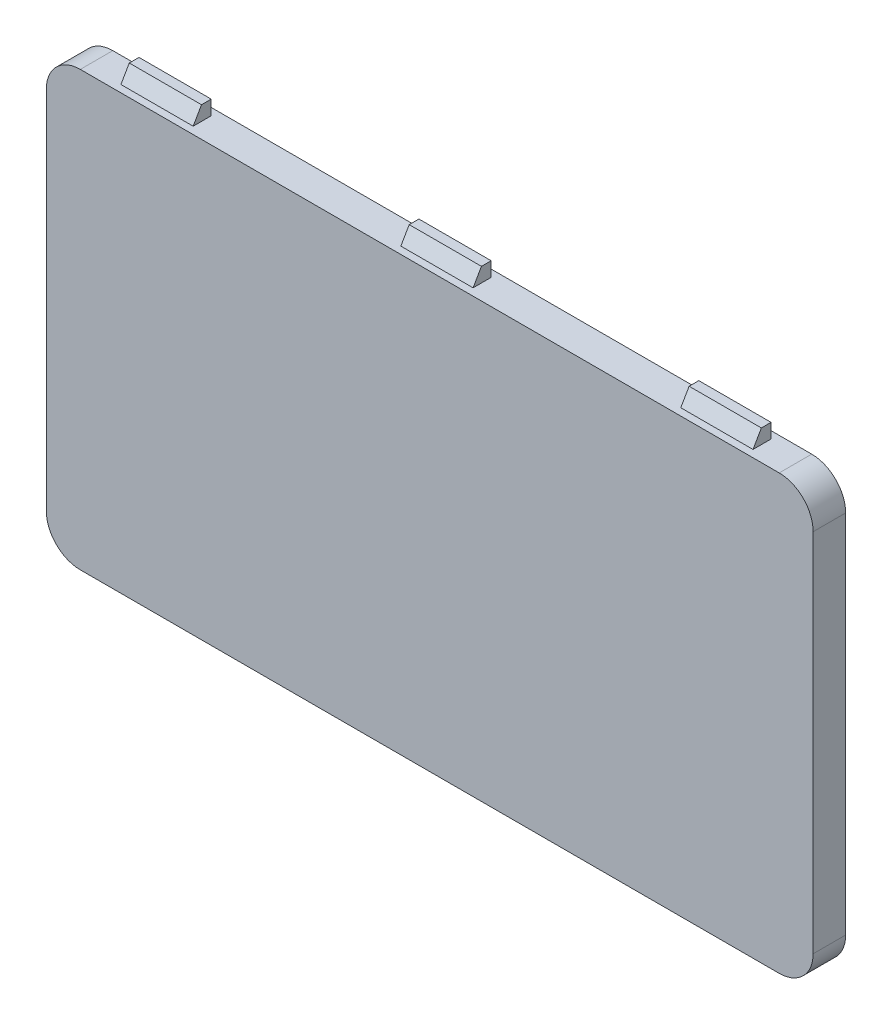
ISO-10303-21;
HEADER;
FILE_DESCRIPTION(('STEP AP214'),'2;1');
FILE_NAME('part.step','',(''),(''),'','','');
FILE_SCHEMA(('AUTOMOTIVE_DESIGN { 1 0 10303 214 1 1 1 1 }'));
ENDSEC;
DATA;
#1=APPLICATION_CONTEXT('core data for automotive mechanical design processes');
#2=APPLICATION_PROTOCOL_DEFINITION('international standard','automotive_design',2000,#1);
#3=PRODUCT_CONTEXT('',#1,'mechanical');
#4=PRODUCT('Part','Part','',(#3));
#5=PRODUCT_RELATED_PRODUCT_CATEGORY('part','',(#4));
#6=PRODUCT_DEFINITION_FORMATION('','',#4);
#7=PRODUCT_DEFINITION_CONTEXT('part definition',#1,'design');
#8=PRODUCT_DEFINITION('design','',#6,#7);
#9=PRODUCT_DEFINITION_SHAPE('','',#8);
#10=(LENGTH_UNIT() NAMED_UNIT(*) SI_UNIT(.MILLI.,.METRE.));
#11=(NAMED_UNIT(*) PLANE_ANGLE_UNIT() SI_UNIT($,.RADIAN.));
#12=(NAMED_UNIT(*) SI_UNIT($,.STERADIAN.) SOLID_ANGLE_UNIT());
#13=UNCERTAINTY_MEASURE_WITH_UNIT(LENGTH_MEASURE(1.E-05),#10,'distance_accuracy_value','');
#14=(GEOMETRIC_REPRESENTATION_CONTEXT(3) GLOBAL_UNCERTAINTY_ASSIGNED_CONTEXT((#13)) GLOBAL_UNIT_ASSIGNED_CONTEXT((#10,
#11,#12)) REPRESENTATION_CONTEXT('',''));
#15=CARTESIAN_POINT('',(0.,0.,0.));
#16=DIRECTION('',(0.,0.,1.));
#17=DIRECTION('',(1.,0.,0.));
#18=AXIS2_PLACEMENT_3D('',#15,#16,#17);
#19=CARTESIAN_POINT('',(-19.35,10.12,1.8));
#20=DIRECTION('',(0.,0.,-1.));
#21=DIRECTION('',(-1.,0.,0.));
#22=AXIS2_PLACEMENT_3D('',#19,#20,#21);
#23=CYLINDRICAL_SURFACE('',#22,1.88);
#24=CARTESIAN_POINT('',(-19.35,10.12,0.));
#25=DIRECTION('',(0.,0.,1.));
#26=DIRECTION('',(1.,0.,0.));
#27=AXIS2_PLACEMENT_3D('',#24,#25,#26);
#28=CIRCLE('',#27,1.88);
#29=CARTESIAN_POINT('',(-19.35,12.,0.));
#30=VERTEX_POINT('',#29);
#31=CARTESIAN_POINT('',(-21.23,10.12,0.));
#32=VERTEX_POINT('',#31);
#33=EDGE_CURVE('E432',#30,#32,#28,.T.);
#34=ORIENTED_EDGE('',*,*,#33,.T.);
#35=DIRECTION('',(0.,0.,-1.));
#36=VECTOR('',#35,1.);
#37=CARTESIAN_POINT('',(-21.23,10.12,1.8));
#38=LINE('',#37,#36);
#39=CARTESIAN_POINT('',(-21.23,10.12,1.8));
#40=VERTEX_POINT('',#39);
#41=EDGE_CURVE('E11',#40,#32,#38,.T.);
#42=ORIENTED_EDGE('',*,*,#41,.F.);
#43=CARTESIAN_POINT('',(-19.35,10.12,1.8));
#44=DIRECTION('',(0.,0.,1.));
#45=DIRECTION('',(1.,0.,0.));
#46=AXIS2_PLACEMENT_3D('',#43,#44,#45);
#47=CIRCLE('',#46,1.88);
#48=CARTESIAN_POINT('',(-19.35,12.,1.8));
#49=VERTEX_POINT('',#48);
#50=EDGE_CURVE('E433',#49,#40,#47,.T.);
#51=ORIENTED_EDGE('',*,*,#50,.F.);
#52=DIRECTION('',(0.,0.,-1.));
#53=VECTOR('',#52,1.);
#54=CARTESIAN_POINT('',(-19.35,12.,1.8));
#55=LINE('',#54,#53);
#56=EDGE_CURVE('E451',#49,#30,#55,.T.);
#57=ORIENTED_EDGE('',*,*,#56,.T.);
#58=EDGE_LOOP('',(#34,#42,#51,#57));
#59=FACE_BOUND('',#58,.T.);
#60=ADVANCED_FACE('F34',(#59),#23,.T.);
#61=CARTESIAN_POINT('',(-21.23,10.12,1.8));
#62=DIRECTION('',(1.,0.,0.));
#63=DIRECTION('',(0.,0.,-1.));
#64=AXIS2_PLACEMENT_3D('',#61,#62,#63);
#65=PLANE('',#64);
#66=DIRECTION('',(0.,-1.,0.));
#67=VECTOR('',#66,1.);
#68=CARTESIAN_POINT('',(-21.23,10.12,0.));
#69=LINE('',#68,#67);
#70=CARTESIAN_POINT('',(-21.23,-10.12,0.));
#71=VERTEX_POINT('',#70);
#72=EDGE_CURVE('E454',#32,#71,#69,.T.);
#73=ORIENTED_EDGE('',*,*,#72,.T.);
#74=DIRECTION('',(0.,0.,-1.));
#75=VECTOR('',#74,1.);
#76=CARTESIAN_POINT('',(-21.23,-10.12,1.8));
#77=LINE('',#76,#75);
#78=CARTESIAN_POINT('',(-21.23,-10.12,1.8));
#79=VERTEX_POINT('',#78);
#80=EDGE_CURVE('E41',#79,#71,#77,.T.);
#81=ORIENTED_EDGE('',*,*,#80,.F.);
#82=DIRECTION('',(0.,-1.,0.));
#83=VECTOR('',#82,1.);
#84=CARTESIAN_POINT('',(-21.23,10.12,1.8));
#85=LINE('',#84,#83);
#86=EDGE_CURVE('E436',#40,#79,#85,.T.);
#87=ORIENTED_EDGE('',*,*,#86,.F.);
#88=ORIENTED_EDGE('',*,*,#41,.T.);
#89=EDGE_LOOP('',(#73,#81,#87,#88));
#90=FACE_BOUND('',#89,.T.);
#91=ADVANCED_FACE('F511',(#90),#65,.F.);
#92=CARTESIAN_POINT('',(-19.35,-10.12,1.8));
#93=DIRECTION('',(0.,0.,-1.));
#94=DIRECTION('',(-1.,0.,0.));
#95=AXIS2_PLACEMENT_3D('',#92,#93,#94);
#96=CYLINDRICAL_SURFACE('',#95,1.88);
#97=CARTESIAN_POINT('',(-19.35,-10.12,0.));
#98=DIRECTION('',(0.,0.,1.));
#99=DIRECTION('',(1.,0.,0.));
#100=AXIS2_PLACEMENT_3D('',#97,#98,#99);
#101=CIRCLE('',#100,1.88);
#102=CARTESIAN_POINT('',(-19.35,-12.,0.));
#103=VERTEX_POINT('',#102);
#104=EDGE_CURVE('E456',#71,#103,#101,.T.);
#105=ORIENTED_EDGE('',*,*,#104,.T.);
#106=DIRECTION('',(0.,0.,-1.));
#107=VECTOR('',#106,1.);
#108=CARTESIAN_POINT('',(-19.35,-12.,1.8));
#109=LINE('',#108,#107);
#110=CARTESIAN_POINT('',(-19.35,-12.,1.8));
#111=VERTEX_POINT('',#110);
#112=EDGE_CURVE('E481',#111,#103,#109,.T.);
#113=ORIENTED_EDGE('',*,*,#112,.F.);
#114=CARTESIAN_POINT('',(-19.35,-10.12,1.8));
#115=DIRECTION('',(0.,0.,1.));
#116=DIRECTION('',(1.,0.,0.));
#117=AXIS2_PLACEMENT_3D('',#114,#115,#116);
#118=CIRCLE('',#117,1.88);
#119=EDGE_CURVE('E439',#79,#111,#118,.T.);
#120=ORIENTED_EDGE('',*,*,#119,.F.);
#121=ORIENTED_EDGE('',*,*,#80,.T.);
#122=EDGE_LOOP('',(#105,#113,#120,#121));
#123=FACE_BOUND('',#122,.T.);
#124=ADVANCED_FACE('F488',(#123),#96,.T.);
#125=CARTESIAN_POINT('',(-19.35,-12.,1.8));
#126=DIRECTION('',(0.,1.,0.));
#127=DIRECTION('',(-1.,0.,0.));
#128=AXIS2_PLACEMENT_3D('',#125,#126,#127);
#129=PLANE('',#128);
#130=DIRECTION('',(-1.,0.,0.));
#131=VECTOR('',#130,1.);
#132=CARTESIAN_POINT('',(-13.5,-12.,1.4));
#133=LINE('',#132,#131);
#134=CARTESIAN_POINT('',(-13.5,-12.,1.4));
#135=VERTEX_POINT('',#134);
#136=CARTESIAN_POINT('',(-17.5,-12.,1.4));
#137=VERTEX_POINT('',#136);
#138=EDGE_CURVE('E305',#135,#137,#133,.T.);
#139=ORIENTED_EDGE('',*,*,#138,.F.);
#140=DIRECTION('',(0.,0.,-1.));
#141=VECTOR('',#140,1.);
#142=CARTESIAN_POINT('',(-13.5,-12.,0.4));
#143=LINE('',#142,#141);
#144=CARTESIAN_POINT('',(-13.5,-12.,0.4));
#145=VERTEX_POINT('',#144);
#146=EDGE_CURVE('E277',#135,#145,#143,.T.);
#147=ORIENTED_EDGE('',*,*,#146,.T.);
#148=DIRECTION('',(-1.,0.,0.));
#149=VECTOR('',#148,1.);
#150=CARTESIAN_POINT('',(-13.5,-12.,0.4));
#151=LINE('',#150,#149);
#152=CARTESIAN_POINT('',(-17.5,-12.,0.4));
#153=VERTEX_POINT('',#152);
#154=EDGE_CURVE('E289',#145,#153,#151,.T.);
#155=ORIENTED_EDGE('',*,*,#154,.T.);
#156=DIRECTION('',(0.,0.,-1.));
#157=VECTOR('',#156,1.);
#158=CARTESIAN_POINT('',(-17.5,-12.,0.4));
#159=LINE('',#158,#157);
#160=EDGE_CURVE('E276',#137,#153,#159,.T.);
#161=ORIENTED_EDGE('',*,*,#160,.F.);
#162=EDGE_LOOP('',(#139,#147,#155,#161));
#163=FACE_BOUND('',#162,.T.);
#164=DIRECTION('',(-1.,0.,0.));
#165=VECTOR('',#164,1.);
#166=CARTESIAN_POINT('',(17.5,-12.,1.4));
#167=LINE('',#166,#165);
#168=CARTESIAN_POINT('',(17.5,-12.,1.4));
#169=VERTEX_POINT('',#168);
#170=CARTESIAN_POINT('',(13.5,-12.,1.4));
#171=VERTEX_POINT('',#170);
#172=EDGE_CURVE('E367',#169,#171,#167,.T.);
#173=ORIENTED_EDGE('',*,*,#172,.F.);
#174=DIRECTION('',(0.,0.,-1.));
#175=VECTOR('',#174,1.);
#176=CARTESIAN_POINT('',(17.5,-12.,0.4));
#177=LINE('',#176,#175);
#178=CARTESIAN_POINT('',(17.5,-12.,0.4));
#179=VERTEX_POINT('',#178);
#180=EDGE_CURVE('E339',#169,#179,#177,.T.);
#181=ORIENTED_EDGE('',*,*,#180,.T.);
#182=DIRECTION('',(-1.,0.,0.));
#183=VECTOR('',#182,1.);
#184=CARTESIAN_POINT('',(17.5,-12.,0.4));
#185=LINE('',#184,#183);
#186=CARTESIAN_POINT('',(13.5,-12.,0.4));
#187=VERTEX_POINT('',#186);
#188=EDGE_CURVE('E351',#179,#187,#185,.T.);
#189=ORIENTED_EDGE('',*,*,#188,.T.);
#190=DIRECTION('',(0.,0.,-1.));
#191=VECTOR('',#190,1.);
#192=CARTESIAN_POINT('',(13.5,-12.,0.4));
#193=LINE('',#192,#191);
#194=EDGE_CURVE('E338',#171,#187,#193,.T.);
#195=ORIENTED_EDGE('',*,*,#194,.F.);
#196=EDGE_LOOP('',(#173,#181,#189,#195));
#197=FACE_BOUND('',#196,.T.);
#198=DIRECTION('',(-1.,0.,0.));
#199=VECTOR('',#198,1.);
#200=CARTESIAN_POINT('',(2.,-12.,1.4));
#201=LINE('',#200,#199);
#202=CARTESIAN_POINT('',(2.,-12.,1.4));
#203=VERTEX_POINT('',#202);
#204=CARTESIAN_POINT('',(-2.,-12.,1.4));
#205=VERTEX_POINT('',#204);
#206=EDGE_CURVE('E399',#203,#205,#201,.T.);
#207=ORIENTED_EDGE('',*,*,#206,.F.);
#208=DIRECTION('',(0.,0.,-1.));
#209=VECTOR('',#208,1.);
#210=CARTESIAN_POINT('',(2.,-12.,0.4));
#211=LINE('',#210,#209);
#212=CARTESIAN_POINT('',(2.,-12.,0.4));
#213=VERTEX_POINT('',#212);
#214=EDGE_CURVE('E371',#203,#213,#211,.T.);
#215=ORIENTED_EDGE('',*,*,#214,.T.);
#216=DIRECTION('',(-1.,0.,0.));
#217=VECTOR('',#216,1.);
#218=CARTESIAN_POINT('',(2.,-12.,0.4));
#219=LINE('',#218,#217);
#220=CARTESIAN_POINT('',(-2.,-12.,0.4));
#221=VERTEX_POINT('',#220);
#222=EDGE_CURVE('E383',#213,#221,#219,.T.);
#223=ORIENTED_EDGE('',*,*,#222,.T.);
#224=DIRECTION('',(0.,0.,-1.));
#225=VECTOR('',#224,1.);
#226=CARTESIAN_POINT('',(-2.,-12.,0.4));
#227=LINE('',#226,#225);
#228=EDGE_CURVE('E370',#205,#221,#227,.T.);
#229=ORIENTED_EDGE('',*,*,#228,.F.);
#230=EDGE_LOOP('',(#207,#215,#223,#229));
#231=FACE_BOUND('',#230,.T.);
#232=DIRECTION('',(1.,0.,0.));
#233=VECTOR('',#232,1.);
#234=CARTESIAN_POINT('',(-19.35,-12.,0.));
#235=LINE('',#234,#233);
#236=CARTESIAN_POINT('',(19.35,-12.,0.));
#237=VERTEX_POINT('',#236);
#238=EDGE_CURVE('E458',#103,#237,#235,.T.);
#239=ORIENTED_EDGE('',*,*,#238,.T.);
#240=DIRECTION('',(0.,0.,-1.));
#241=VECTOR('',#240,1.);
#242=CARTESIAN_POINT('',(19.35,-12.,1.8));
#243=LINE('',#242,#241);
#244=CARTESIAN_POINT('',(19.35,-12.,1.8));
#245=VERTEX_POINT('',#244);
#246=EDGE_CURVE('E478',#245,#237,#243,.T.);
#247=ORIENTED_EDGE('',*,*,#246,.F.);
#248=DIRECTION('',(1.,0.,0.));
#249=VECTOR('',#248,1.);
#250=CARTESIAN_POINT('',(-19.35,-12.,1.8));
#251=LINE('',#250,#249);
#252=EDGE_CURVE('E441',#111,#245,#251,.T.);
#253=ORIENTED_EDGE('',*,*,#252,.F.);
#254=ORIENTED_EDGE('',*,*,#112,.T.);
#255=EDGE_LOOP('',(#239,#247,#253,#254));
#256=FACE_BOUND('',#255,.T.);
#257=ADVANCED_FACE('F499',(#163,#197,#231,#256),#129,.F.);
#258=CARTESIAN_POINT('',(19.35,-10.12,1.8));
#259=DIRECTION('',(0.,0.,-1.));
#260=DIRECTION('',(-1.,0.,0.));
#261=AXIS2_PLACEMENT_3D('',#258,#259,#260);
#262=CYLINDRICAL_SURFACE('',#261,1.88);
#263=CARTESIAN_POINT('',(19.35,-10.12,0.));
#264=DIRECTION('',(0.,0.,1.));
#265=DIRECTION('',(1.,0.,0.));
#266=AXIS2_PLACEMENT_3D('',#263,#264,#265);
#267=CIRCLE('',#266,1.88);
#268=CARTESIAN_POINT('',(21.23,-10.12,0.));
#269=VERTEX_POINT('',#268);
#270=EDGE_CURVE('E460',#237,#269,#267,.T.);
#271=ORIENTED_EDGE('',*,*,#270,.T.);
#272=DIRECTION('',(0.,0.,-1.));
#273=VECTOR('',#272,1.);
#274=CARTESIAN_POINT('',(21.23,-10.12,1.8));
#275=LINE('',#274,#273);
#276=CARTESIAN_POINT('',(21.23,-10.12,1.8));
#277=VERTEX_POINT('',#276);
#278=EDGE_CURVE('E475',#277,#269,#275,.T.);
#279=ORIENTED_EDGE('',*,*,#278,.F.);
#280=CARTESIAN_POINT('',(19.35,-10.12,1.8));
#281=DIRECTION('',(0.,0.,1.));
#282=DIRECTION('',(1.,0.,0.));
#283=AXIS2_PLACEMENT_3D('',#280,#281,#282);
#284=CIRCLE('',#283,1.88);
#285=EDGE_CURVE('E443',#245,#277,#284,.T.);
#286=ORIENTED_EDGE('',*,*,#285,.F.);
#287=ORIENTED_EDGE('',*,*,#246,.T.);
#288=EDGE_LOOP('',(#271,#279,#286,#287));
#289=FACE_BOUND('',#288,.T.);
#290=ADVANCED_FACE('F503',(#289),#262,.T.);
#291=CARTESIAN_POINT('',(21.23,-10.12,1.8));
#292=DIRECTION('',(-1.,0.,0.));
#293=DIRECTION('',(0.,-1.,0.));
#294=AXIS2_PLACEMENT_3D('',#291,#292,#293);
#295=PLANE('',#294);
#296=DIRECTION('',(0.,1.,0.));
#297=VECTOR('',#296,1.);
#298=CARTESIAN_POINT('',(21.23,-10.12,0.));
#299=LINE('',#298,#297);
#300=CARTESIAN_POINT('',(21.23,10.12,0.));
#301=VERTEX_POINT('',#300);
#302=EDGE_CURVE('E462',#269,#301,#299,.T.);
#303=ORIENTED_EDGE('',*,*,#302,.T.);
#304=DIRECTION('',(0.,0.,-1.));
#305=VECTOR('',#304,1.);
#306=CARTESIAN_POINT('',(21.23,10.12,1.8));
#307=LINE('',#306,#305);
#308=CARTESIAN_POINT('',(21.23,10.12,1.8));
#309=VERTEX_POINT('',#308);
#310=EDGE_CURVE('E472',#309,#301,#307,.T.);
#311=ORIENTED_EDGE('',*,*,#310,.F.);
#312=DIRECTION('',(0.,1.,0.));
#313=VECTOR('',#312,1.);
#314=CARTESIAN_POINT('',(21.23,-10.12,1.8));
#315=LINE('',#314,#313);
#316=EDGE_CURVE('E445',#277,#309,#315,.T.);
#317=ORIENTED_EDGE('',*,*,#316,.F.);
#318=ORIENTED_EDGE('',*,*,#278,.T.);
#319=EDGE_LOOP('',(#303,#311,#317,#318));
#320=FACE_BOUND('',#319,.T.);
#321=ADVANCED_FACE('F524',(#320),#295,.F.);
#322=CARTESIAN_POINT('',(19.35,10.12,1.8));
#323=DIRECTION('',(0.,0.,-1.));
#324=DIRECTION('',(-1.,0.,0.));
#325=AXIS2_PLACEMENT_3D('',#322,#323,#324);
#326=CYLINDRICAL_SURFACE('',#325,1.88);
#327=CARTESIAN_POINT('',(19.35,10.12,0.));
#328=DIRECTION('',(0.,0.,1.));
#329=DIRECTION('',(1.,0.,0.));
#330=AXIS2_PLACEMENT_3D('',#327,#328,#329);
#331=CIRCLE('',#330,1.88);
#332=CARTESIAN_POINT('',(19.35,12.,0.));
#333=VERTEX_POINT('',#332);
#334=EDGE_CURVE('E464',#301,#333,#331,.T.);
#335=ORIENTED_EDGE('',*,*,#334,.T.);
#336=DIRECTION('',(0.,0.,-1.));
#337=VECTOR('',#336,1.);
#338=CARTESIAN_POINT('',(19.35,12.,1.8));
#339=LINE('',#338,#337);
#340=CARTESIAN_POINT('',(19.35,12.,1.8));
#341=VERTEX_POINT('',#340);
#342=EDGE_CURVE('E469',#341,#333,#339,.T.);
#343=ORIENTED_EDGE('',*,*,#342,.F.);
#344=CARTESIAN_POINT('',(19.35,10.12,1.8));
#345=DIRECTION('',(0.,0.,1.));
#346=DIRECTION('',(1.,0.,0.));
#347=AXIS2_PLACEMENT_3D('',#344,#345,#346);
#348=CIRCLE('',#347,1.88);
#349=EDGE_CURVE('E447',#309,#341,#348,.T.);
#350=ORIENTED_EDGE('',*,*,#349,.F.);
#351=ORIENTED_EDGE('',*,*,#310,.T.);
#352=EDGE_LOOP('',(#335,#343,#350,#351));
#353=FACE_BOUND('',#352,.T.);
#354=ADVANCED_FACE('F522',(#353),#326,.T.);
#355=CARTESIAN_POINT('',(19.35,12.,1.8));
#356=DIRECTION('',(0.,-1.,0.));
#357=DIRECTION('',(0.,0.,-1.));
#358=AXIS2_PLACEMENT_3D('',#355,#356,#357);
#359=PLANE('',#358);
#360=DIRECTION('',(-1.,0.,0.));
#361=VECTOR('',#360,1.);
#362=CARTESIAN_POINT('',(-13.5,12.,0.4));
#363=LINE('',#362,#361);
#364=CARTESIAN_POINT('',(-13.5,12.,0.4));
#365=VERTEX_POINT('',#364);
#366=CARTESIAN_POINT('',(-17.5,12.,0.4));
#367=VERTEX_POINT('',#366);
#368=EDGE_CURVE('E48',#365,#367,#363,.T.);
#369=ORIENTED_EDGE('',*,*,#368,.F.);
#370=DIRECTION('',(0.,0.,-1.));
#371=VECTOR('',#370,1.);
#372=CARTESIAN_POINT('',(-13.5,12.,0.4));
#373=LINE('',#372,#371);
#374=CARTESIAN_POINT('',(-13.5,12.,1.4));
#375=VERTEX_POINT('',#374);
#376=EDGE_CURVE('E53',#375,#365,#373,.T.);
#377=ORIENTED_EDGE('',*,*,#376,.F.);
#378=DIRECTION('',(-1.,0.,0.));
#379=VECTOR('',#378,1.);
#380=CARTESIAN_POINT('',(-13.5,12.,1.4));
#381=LINE('',#380,#379);
#382=CARTESIAN_POINT('',(-17.5,12.,1.4));
#383=VERTEX_POINT('',#382);
#384=EDGE_CURVE('E261',#375,#383,#381,.T.);
#385=ORIENTED_EDGE('',*,*,#384,.T.);
#386=DIRECTION('',(0.,0.,-1.));
#387=VECTOR('',#386,1.);
#388=CARTESIAN_POINT('',(-17.5,12.,0.4));
#389=LINE('',#388,#387);
#390=EDGE_CURVE('E265',#383,#367,#389,.T.);
#391=ORIENTED_EDGE('',*,*,#390,.T.);
#392=EDGE_LOOP('',(#369,#377,#385,#391));
#393=FACE_BOUND('',#392,.T.);
#394=DIRECTION('',(-1.,0.,0.));
#395=VECTOR('',#394,1.);
#396=CARTESIAN_POINT('',(17.5,12.,0.4));
#397=LINE('',#396,#395);
#398=CARTESIAN_POINT('',(17.5,12.,0.4));
#399=VERTEX_POINT('',#398);
#400=CARTESIAN_POINT('',(13.5,12.,0.4));
#401=VERTEX_POINT('',#400);
#402=EDGE_CURVE('E335',#399,#401,#397,.T.);
#403=ORIENTED_EDGE('',*,*,#402,.F.);
#404=DIRECTION('',(0.,0.,-1.));
#405=VECTOR('',#404,1.);
#406=CARTESIAN_POINT('',(17.5,12.,0.4));
#407=LINE('',#406,#405);
#408=CARTESIAN_POINT('',(17.5,12.,1.4));
#409=VERTEX_POINT('',#408);
#410=EDGE_CURVE('E309',#409,#399,#407,.T.);
#411=ORIENTED_EDGE('',*,*,#410,.F.);
#412=DIRECTION('',(-1.,0.,0.));
#413=VECTOR('',#412,1.);
#414=CARTESIAN_POINT('',(17.5,12.,1.4));
#415=LINE('',#414,#413);
#416=CARTESIAN_POINT('',(13.5,12.,1.4));
#417=VERTEX_POINT('',#416);
#418=EDGE_CURVE('E320',#409,#417,#415,.T.);
#419=ORIENTED_EDGE('',*,*,#418,.T.);
#420=DIRECTION('',(0.,0.,-1.));
#421=VECTOR('',#420,1.);
#422=CARTESIAN_POINT('',(13.5,12.,0.4));
#423=LINE('',#422,#421);
#424=EDGE_CURVE('E308',#417,#401,#423,.T.);
#425=ORIENTED_EDGE('',*,*,#424,.T.);
#426=EDGE_LOOP('',(#403,#411,#419,#425));
#427=FACE_BOUND('',#426,.T.);
#428=DIRECTION('',(-1.,0.,0.));
#429=VECTOR('',#428,1.);
#430=CARTESIAN_POINT('',(2.,12.,0.4));
#431=LINE('',#430,#429);
#432=CARTESIAN_POINT('',(2.,12.,0.4));
#433=VERTEX_POINT('',#432);
#434=CARTESIAN_POINT('',(-2.,12.,0.4));
#435=VERTEX_POINT('',#434);
#436=EDGE_CURVE('E429',#433,#435,#431,.T.);
#437=ORIENTED_EDGE('',*,*,#436,.F.);
#438=DIRECTION('',(0.,0.,-1.));
#439=VECTOR('',#438,1.);
#440=CARTESIAN_POINT('',(2.,12.,0.4));
#441=LINE('',#440,#439);
#442=CARTESIAN_POINT('',(2.,12.,1.4));
#443=VERTEX_POINT('',#442);
#444=EDGE_CURVE('E403',#443,#433,#441,.T.);
#445=ORIENTED_EDGE('',*,*,#444,.F.);
#446=DIRECTION('',(-1.,0.,0.));
#447=VECTOR('',#446,1.);
#448=CARTESIAN_POINT('',(2.,12.,1.4));
#449=LINE('',#448,#447);
#450=CARTESIAN_POINT('',(-2.,12.,1.4));
#451=VERTEX_POINT('',#450);
#452=EDGE_CURVE('E414',#443,#451,#449,.T.);
#453=ORIENTED_EDGE('',*,*,#452,.T.);
#454=DIRECTION('',(0.,0.,-1.));
#455=VECTOR('',#454,1.);
#456=CARTESIAN_POINT('',(-2.,12.,0.4));
#457=LINE('',#456,#455);
#458=EDGE_CURVE('E402',#451,#435,#457,.T.);
#459=ORIENTED_EDGE('',*,*,#458,.T.);
#460=EDGE_LOOP('',(#437,#445,#453,#459));
#461=FACE_BOUND('',#460,.T.);
#462=DIRECTION('',(-1.,0.,0.));
#463=VECTOR('',#462,1.);
#464=CARTESIAN_POINT('',(19.35,12.,0.));
#465=LINE('',#464,#463);
#466=EDGE_CURVE('E437',#333,#30,#465,.T.);
#467=ORIENTED_EDGE('',*,*,#466,.T.);
#468=ORIENTED_EDGE('',*,*,#56,.F.);
#469=DIRECTION('',(-1.,0.,0.));
#470=VECTOR('',#469,1.);
#471=CARTESIAN_POINT('',(19.35,12.,1.8));
#472=LINE('',#471,#470);
#473=EDGE_CURVE('E449',#341,#49,#472,.T.);
#474=ORIENTED_EDGE('',*,*,#473,.F.);
#475=ORIENTED_EDGE('',*,*,#342,.T.);
#476=EDGE_LOOP('',(#467,#468,#474,#475));
#477=FACE_BOUND('',#476,.T.);
#478=ADVANCED_FACE('F517',(#393,#427,#461,#477),#359,.F.);
#479=CARTESIAN_POINT('',(-19.35,10.12,1.8));
#480=DIRECTION('',(0.,0.,1.));
#481=DIRECTION('',(1.,0.,0.));
#482=AXIS2_PLACEMENT_3D('',#479,#480,#481);
#483=PLANE('',#482);
#484=ORIENTED_EDGE('',*,*,#50,.T.);
#485=ORIENTED_EDGE('',*,*,#86,.T.);
#486=ORIENTED_EDGE('',*,*,#119,.T.);
#487=ORIENTED_EDGE('',*,*,#252,.T.);
#488=ORIENTED_EDGE('',*,*,#285,.T.);
#489=ORIENTED_EDGE('',*,*,#316,.T.);
#490=ORIENTED_EDGE('',*,*,#349,.T.);
#491=ORIENTED_EDGE('',*,*,#473,.T.);
#492=EDGE_LOOP('',(#484,#485,#486,#487,#488,#489,#490,#491));
#493=FACE_BOUND('',#492,.T.);
#494=ADVANCED_FACE('F507',(#493),#483,.T.);
#495=CARTESIAN_POINT('',(-19.35,10.12,0.));
#496=DIRECTION('',(0.,0.,1.));
#497=DIRECTION('',(1.,0.,0.));
#498=AXIS2_PLACEMENT_3D('',#495,#496,#497);
#499=PLANE('',#498);
#500=ORIENTED_EDGE('',*,*,#33,.F.);
#501=ORIENTED_EDGE('',*,*,#466,.F.);
#502=ORIENTED_EDGE('',*,*,#334,.F.);
#503=ORIENTED_EDGE('',*,*,#302,.F.);
#504=ORIENTED_EDGE('',*,*,#270,.F.);
#505=ORIENTED_EDGE('',*,*,#238,.F.);
#506=ORIENTED_EDGE('',*,*,#104,.F.);
#507=ORIENTED_EDGE('',*,*,#72,.F.);
#508=EDGE_LOOP('',(#500,#501,#502,#503,#504,#505,#506,#507));
#509=FACE_BOUND('',#508,.T.);
#510=ADVANCED_FACE('F494',(#509),#499,.F.);
#511=CARTESIAN_POINT('',(2.,12.8,0.4));
#512=DIRECTION('',(0.,0.,1.));
#513=DIRECTION('',(0.,-1.,0.));
#514=AXIS2_PLACEMENT_3D('',#511,#512,#513);
#515=PLANE('',#514);
#516=DIRECTION('',(0.,1.,0.));
#517=VECTOR('',#516,1.);
#518=CARTESIAN_POINT('',(-2.,12.8,0.4));
#519=LINE('',#518,#517);
#520=CARTESIAN_POINT('',(-2.,12.8,0.4));
#521=VERTEX_POINT('',#520);
#522=EDGE_CURVE('E416',#435,#521,#519,.T.);
#523=ORIENTED_EDGE('',*,*,#522,.T.);
#524=DIRECTION('',(-1.,0.,0.));
#525=VECTOR('',#524,1.);
#526=CARTESIAN_POINT('',(2.,12.8,0.4));
#527=LINE('',#526,#525);
#528=CARTESIAN_POINT('',(2.,12.8,0.4));
#529=VERTEX_POINT('',#528);
#530=EDGE_CURVE('E426',#529,#521,#527,.T.);
#531=ORIENTED_EDGE('',*,*,#530,.F.);
#532=DIRECTION('',(0.,1.,0.));
#533=VECTOR('',#532,1.);
#534=CARTESIAN_POINT('',(2.,12.8,0.4));
#535=LINE('',#534,#533);
#536=EDGE_CURVE('E406',#433,#529,#535,.T.);
#537=ORIENTED_EDGE('',*,*,#536,.F.);
#538=ORIENTED_EDGE('',*,*,#436,.T.);
#539=EDGE_LOOP('',(#523,#531,#537,#538));
#540=FACE_BOUND('',#539,.T.);
#541=ADVANCED_FACE('F601',(#540),#515,.F.);
#542=CARTESIAN_POINT('',(2.,12.8,0.938119784648295));
#543=DIRECTION('',(0.,-1.,0.));
#544=DIRECTION('',(0.,0.,-1.));
#545=AXIS2_PLACEMENT_3D('',#542,#543,#544);
#546=PLANE('',#545);
#547=DIRECTION('',(0.,0.,1.));
#548=VECTOR('',#547,1.);
#549=CARTESIAN_POINT('',(-2.,12.8,0.938119784648295));
#550=LINE('',#549,#548);
#551=CARTESIAN_POINT('',(-2.,12.8,0.938119784648295));
#552=VERTEX_POINT('',#551);
#553=EDGE_CURVE('E418',#521,#552,#550,.T.);
#554=ORIENTED_EDGE('',*,*,#553,.T.);
#555=DIRECTION('',(-1.,0.,0.));
#556=VECTOR('',#555,1.);
#557=CARTESIAN_POINT('',(2.,12.8,0.938119784648295));
#558=LINE('',#557,#556);
#559=CARTESIAN_POINT('',(2.,12.8,0.938119784648295));
#560=VERTEX_POINT('',#559);
#561=EDGE_CURVE('E423',#560,#552,#558,.T.);
#562=ORIENTED_EDGE('',*,*,#561,.F.);
#563=DIRECTION('',(0.,0.,1.));
#564=VECTOR('',#563,1.);
#565=CARTESIAN_POINT('',(2.,12.8,0.938119784648295));
#566=LINE('',#565,#564);
#567=EDGE_CURVE('E409',#529,#560,#566,.T.);
#568=ORIENTED_EDGE('',*,*,#567,.F.);
#569=ORIENTED_EDGE('',*,*,#530,.T.);
#570=EDGE_LOOP('',(#554,#562,#568,#569));
#571=FACE_BOUND('',#570,.T.);
#572=ADVANCED_FACE('F597',(#571),#546,.F.);
#573=CARTESIAN_POINT('',(2.,12.,1.4));
#574=DIRECTION('',(0.,-0.500000000000002,-0.866025403784438));
#575=DIRECTION('',(0.,0.866025403784438,-0.500000000000002));
#576=AXIS2_PLACEMENT_3D('',#573,#574,#575);
#577=PLANE('',#576);
#578=DIRECTION('',(0.,-0.866025403784437,0.500000000000002));
#579=VECTOR('',#578,1.);
#580=CARTESIAN_POINT('',(-2.,12.,1.4));
#581=LINE('',#580,#579);
#582=EDGE_CURVE('E407',#552,#451,#581,.T.);
#583=ORIENTED_EDGE('',*,*,#582,.T.);
#584=ORIENTED_EDGE('',*,*,#452,.F.);
#585=DIRECTION('',(0.,-0.866025403784437,0.500000000000002));
#586=VECTOR('',#585,1.);
#587=CARTESIAN_POINT('',(2.,12.,1.4));
#588=LINE('',#587,#586);
#589=EDGE_CURVE('E411',#560,#443,#588,.T.);
#590=ORIENTED_EDGE('',*,*,#589,.F.);
#591=ORIENTED_EDGE('',*,*,#561,.T.);
#592=EDGE_LOOP('',(#583,#584,#590,#591));
#593=FACE_BOUND('',#592,.T.);
#594=ADVANCED_FACE('F590',(#593),#577,.F.);
#595=CARTESIAN_POINT('',(2.,0.,0.));
#596=DIRECTION('',(1.,0.,0.));
#597=DIRECTION('',(0.,0.,-1.));
#598=AXIS2_PLACEMENT_3D('',#595,#596,#597);
#599=PLANE('',#598);
#600=ORIENTED_EDGE('',*,*,#444,.T.);
#601=ORIENTED_EDGE('',*,*,#536,.T.);
#602=ORIENTED_EDGE('',*,*,#567,.T.);
#603=ORIENTED_EDGE('',*,*,#589,.T.);
#604=EDGE_LOOP('',(#600,#601,#602,#603));
#605=FACE_BOUND('',#604,.T.);
#606=ADVANCED_FACE('F587',(#605),#599,.T.);
#607=CARTESIAN_POINT('',(-2.,0.,0.));
#608=DIRECTION('',(1.,0.,0.));
#609=DIRECTION('',(0.,0.,-1.));
#610=AXIS2_PLACEMENT_3D('',#607,#608,#609);
#611=PLANE('',#610);
#612=ORIENTED_EDGE('',*,*,#458,.F.);
#613=ORIENTED_EDGE('',*,*,#582,.F.);
#614=ORIENTED_EDGE('',*,*,#553,.F.);
#615=ORIENTED_EDGE('',*,*,#522,.F.);
#616=EDGE_LOOP('',(#612,#613,#614,#615));
#617=FACE_BOUND('',#616,.T.);
#618=ADVANCED_FACE('F586',(#617),#611,.F.);
#619=CARTESIAN_POINT('',(2.,-12.,1.4));
#620=DIRECTION('',(0.,-0.500000000000002,0.866025403784438));
#621=DIRECTION('',(0.,-0.866025403784438,-0.500000000000002));
#622=AXIS2_PLACEMENT_3D('',#619,#620,#621);
#623=PLANE('',#622);
#624=DIRECTION('',(0.,0.866025403784437,0.500000000000002));
#625=VECTOR('',#624,1.);
#626=CARTESIAN_POINT('',(-2.,-12.,1.4));
#627=LINE('',#626,#625);
#628=CARTESIAN_POINT('',(-2.,-12.8,0.938119784648295));
#629=VERTEX_POINT('',#628);
#630=EDGE_CURVE('E386',#629,#205,#627,.T.);
#631=ORIENTED_EDGE('',*,*,#630,.F.);
#632=DIRECTION('',(-1.,0.,0.));
#633=VECTOR('',#632,1.);
#634=CARTESIAN_POINT('',(2.,-12.8,0.938119784648295));
#635=LINE('',#634,#633);
#636=CARTESIAN_POINT('',(2.,-12.8,0.938119784648295));
#637=VERTEX_POINT('',#636);
#638=EDGE_CURVE('E397',#637,#629,#635,.T.);
#639=ORIENTED_EDGE('',*,*,#638,.F.);
#640=DIRECTION('',(0.,0.866025403784437,0.500000000000002));
#641=VECTOR('',#640,1.);
#642=CARTESIAN_POINT('',(2.,-12.,1.4));
#643=LINE('',#642,#641);
#644=EDGE_CURVE('E373',#637,#203,#643,.T.);
#645=ORIENTED_EDGE('',*,*,#644,.T.);
#646=ORIENTED_EDGE('',*,*,#206,.T.);
#647=EDGE_LOOP('',(#631,#639,#645,#646));
#648=FACE_BOUND('',#647,.T.);
#649=ADVANCED_FACE('F559',(#648),#623,.T.);
#650=CARTESIAN_POINT('',(2.,-12.8,0.938119784648295));
#651=DIRECTION('',(0.,-1.,0.));
#652=DIRECTION('',(0.,0.,-1.));
#653=AXIS2_PLACEMENT_3D('',#650,#651,#652);
#654=PLANE('',#653);
#655=DIRECTION('',(0.,0.,1.));
#656=VECTOR('',#655,1.);
#657=CARTESIAN_POINT('',(-2.,-12.8,0.938119784648295));
#658=LINE('',#657,#656);
#659=CARTESIAN_POINT('',(-2.,-12.8,0.4));
#660=VERTEX_POINT('',#659);
#661=EDGE_CURVE('E389',#660,#629,#658,.T.);
#662=ORIENTED_EDGE('',*,*,#661,.F.);
#663=DIRECTION('',(-1.,0.,0.));
#664=VECTOR('',#663,1.);
#665=CARTESIAN_POINT('',(2.,-12.8,0.4));
#666=LINE('',#665,#664);
#667=CARTESIAN_POINT('',(2.,-12.8,0.4));
#668=VERTEX_POINT('',#667);
#669=EDGE_CURVE('E395',#668,#660,#666,.T.);
#670=ORIENTED_EDGE('',*,*,#669,.F.);
#671=DIRECTION('',(0.,0.,1.));
#672=VECTOR('',#671,1.);
#673=CARTESIAN_POINT('',(2.,-12.8,0.938119784648295));
#674=LINE('',#673,#672);
#675=EDGE_CURVE('E377',#668,#637,#674,.T.);
#676=ORIENTED_EDGE('',*,*,#675,.T.);
#677=ORIENTED_EDGE('',*,*,#638,.T.);
#678=EDGE_LOOP('',(#662,#670,#676,#677));
#679=FACE_BOUND('',#678,.T.);
#680=ADVANCED_FACE('F562',(#679),#654,.T.);
#681=CARTESIAN_POINT('',(2.,-12.8,0.4));
#682=DIRECTION('',(0.,0.,-1.));
#683=DIRECTION('',(0.,1.,0.));
#684=AXIS2_PLACEMENT_3D('',#681,#682,#683);
#685=PLANE('',#684);
#686=DIRECTION('',(0.,-1.,0.));
#687=VECTOR('',#686,1.);
#688=CARTESIAN_POINT('',(-2.,-12.8,0.4));
#689=LINE('',#688,#687);
#690=EDGE_CURVE('E374',#221,#660,#689,.T.);
#691=ORIENTED_EDGE('',*,*,#690,.F.);
#692=ORIENTED_EDGE('',*,*,#222,.F.);
#693=DIRECTION('',(0.,-1.,0.));
#694=VECTOR('',#693,1.);
#695=CARTESIAN_POINT('',(2.,-12.8,0.4));
#696=LINE('',#695,#694);
#697=EDGE_CURVE('E380',#213,#668,#696,.T.);
#698=ORIENTED_EDGE('',*,*,#697,.T.);
#699=ORIENTED_EDGE('',*,*,#669,.T.);
#700=EDGE_LOOP('',(#691,#692,#698,#699));
#701=FACE_BOUND('',#700,.T.);
#702=ADVANCED_FACE('F565',(#701),#685,.T.);
#703=CARTESIAN_POINT('',(2.,0.,0.));
#704=DIRECTION('',(1.,0.,0.));
#705=DIRECTION('',(0.,0.,-1.));
#706=AXIS2_PLACEMENT_3D('',#703,#704,#705);
#707=PLANE('',#706);
#708=ORIENTED_EDGE('',*,*,#214,.F.);
#709=ORIENTED_EDGE('',*,*,#644,.F.);
#710=ORIENTED_EDGE('',*,*,#675,.F.);
#711=ORIENTED_EDGE('',*,*,#697,.F.);
#712=EDGE_LOOP('',(#708,#709,#710,#711));
#713=FACE_BOUND('',#712,.T.);
#714=ADVANCED_FACE('F557',(#713),#707,.T.);
#715=CARTESIAN_POINT('',(-2.,0.,0.));
#716=DIRECTION('',(1.,0.,0.));
#717=DIRECTION('',(0.,0.,-1.));
#718=AXIS2_PLACEMENT_3D('',#715,#716,#717);
#719=PLANE('',#718);
#720=ORIENTED_EDGE('',*,*,#228,.T.);
#721=ORIENTED_EDGE('',*,*,#690,.T.);
#722=ORIENTED_EDGE('',*,*,#661,.T.);
#723=ORIENTED_EDGE('',*,*,#630,.T.);
#724=EDGE_LOOP('',(#720,#721,#722,#723));
#725=FACE_BOUND('',#724,.T.);
#726=ADVANCED_FACE('F567',(#725),#719,.F.);
#727=CARTESIAN_POINT('',(17.5,-12.,1.4));
#728=DIRECTION('',(0.,-0.500000000000002,0.866025403784438));
#729=DIRECTION('',(0.,-0.866025403784438,-0.500000000000002));
#730=AXIS2_PLACEMENT_3D('',#727,#728,#729);
#731=PLANE('',#730);
#732=DIRECTION('',(0.,0.866025403784437,0.500000000000002));
#733=VECTOR('',#732,1.);
#734=CARTESIAN_POINT('',(13.5,-12.,1.4));
#735=LINE('',#734,#733);
#736=CARTESIAN_POINT('',(13.5,-12.8,0.938119784648295));
#737=VERTEX_POINT('',#736);
#738=EDGE_CURVE('E354',#737,#171,#735,.T.);
#739=ORIENTED_EDGE('',*,*,#738,.F.);
#740=DIRECTION('',(-1.,0.,0.));
#741=VECTOR('',#740,1.);
#742=CARTESIAN_POINT('',(17.5,-12.8,0.938119784648295));
#743=LINE('',#742,#741);
#744=CARTESIAN_POINT('',(17.5,-12.8,0.938119784648295));
#745=VERTEX_POINT('',#744);
#746=EDGE_CURVE('E365',#745,#737,#743,.T.);
#747=ORIENTED_EDGE('',*,*,#746,.F.);
#748=DIRECTION('',(0.,0.866025403784437,0.500000000000002));
#749=VECTOR('',#748,1.);
#750=CARTESIAN_POINT('',(17.5,-12.,1.4));
#751=LINE('',#750,#749);
#752=EDGE_CURVE('E341',#745,#169,#751,.T.);
#753=ORIENTED_EDGE('',*,*,#752,.T.);
#754=ORIENTED_EDGE('',*,*,#172,.T.);
#755=EDGE_LOOP('',(#739,#747,#753,#754));
#756=FACE_BOUND('',#755,.T.);
#757=ADVANCED_FACE('F569',(#756),#731,.T.);
#758=CARTESIAN_POINT('',(17.5,-12.8,0.938119784648295));
#759=DIRECTION('',(0.,-1.,0.));
#760=DIRECTION('',(0.,0.,-1.));
#761=AXIS2_PLACEMENT_3D('',#758,#759,#760);
#762=PLANE('',#761);
#763=DIRECTION('',(0.,0.,1.));
#764=VECTOR('',#763,1.);
#765=CARTESIAN_POINT('',(13.5,-12.8,0.938119784648295));
#766=LINE('',#765,#764);
#767=CARTESIAN_POINT('',(13.5,-12.8,0.4));
#768=VERTEX_POINT('',#767);
#769=EDGE_CURVE('E357',#768,#737,#766,.T.);
#770=ORIENTED_EDGE('',*,*,#769,.F.);
#771=DIRECTION('',(-1.,0.,0.));
#772=VECTOR('',#771,1.);
#773=CARTESIAN_POINT('',(17.5,-12.8,0.4));
#774=LINE('',#773,#772);
#775=CARTESIAN_POINT('',(17.5,-12.8,0.4));
#776=VERTEX_POINT('',#775);
#777=EDGE_CURVE('E363',#776,#768,#774,.T.);
#778=ORIENTED_EDGE('',*,*,#777,.F.);
#779=DIRECTION('',(0.,0.,1.));
#780=VECTOR('',#779,1.);
#781=CARTESIAN_POINT('',(17.5,-12.8,0.938119784648295));
#782=LINE('',#781,#780);
#783=EDGE_CURVE('E345',#776,#745,#782,.T.);
#784=ORIENTED_EDGE('',*,*,#783,.T.);
#785=ORIENTED_EDGE('',*,*,#746,.T.);
#786=EDGE_LOOP('',(#770,#778,#784,#785));
#787=FACE_BOUND('',#786,.T.);
#788=ADVANCED_FACE('F575',(#787),#762,.T.);
#789=CARTESIAN_POINT('',(17.5,-12.8,0.4));
#790=DIRECTION('',(0.,0.,-1.));
#791=DIRECTION('',(0.,1.,0.));
#792=AXIS2_PLACEMENT_3D('',#789,#790,#791);
#793=PLANE('',#792);
#794=DIRECTION('',(0.,-1.,0.));
#795=VECTOR('',#794,1.);
#796=CARTESIAN_POINT('',(13.5,-12.8,0.4));
#797=LINE('',#796,#795);
#798=EDGE_CURVE('E342',#187,#768,#797,.T.);
#799=ORIENTED_EDGE('',*,*,#798,.F.);
#800=ORIENTED_EDGE('',*,*,#188,.F.);
#801=DIRECTION('',(0.,-1.,0.));
#802=VECTOR('',#801,1.);
#803=CARTESIAN_POINT('',(17.5,-12.8,0.4));
#804=LINE('',#803,#802);
#805=EDGE_CURVE('E348',#179,#776,#804,.T.);
#806=ORIENTED_EDGE('',*,*,#805,.T.);
#807=ORIENTED_EDGE('',*,*,#777,.T.);
#808=EDGE_LOOP('',(#799,#800,#806,#807));
#809=FACE_BOUND('',#808,.T.);
#810=ADVANCED_FACE('F659',(#809),#793,.T.);
#811=CARTESIAN_POINT('',(17.5,0.,0.));
#812=DIRECTION('',(1.,0.,0.));
#813=DIRECTION('',(0.,0.,-1.));
#814=AXIS2_PLACEMENT_3D('',#811,#812,#813);
#815=PLANE('',#814);
#816=ORIENTED_EDGE('',*,*,#180,.F.);
#817=ORIENTED_EDGE('',*,*,#752,.F.);
#818=ORIENTED_EDGE('',*,*,#783,.F.);
#819=ORIENTED_EDGE('',*,*,#805,.F.);
#820=EDGE_LOOP('',(#816,#817,#818,#819));
#821=FACE_BOUND('',#820,.T.);
#822=ADVANCED_FACE('F656',(#821),#815,.T.);
#823=CARTESIAN_POINT('',(13.5,0.,0.));
#824=DIRECTION('',(1.,0.,0.));
#825=DIRECTION('',(0.,0.,-1.));
#826=AXIS2_PLACEMENT_3D('',#823,#824,#825);
#827=PLANE('',#826);
#828=ORIENTED_EDGE('',*,*,#194,.T.);
#829=ORIENTED_EDGE('',*,*,#798,.T.);
#830=ORIENTED_EDGE('',*,*,#769,.T.);
#831=ORIENTED_EDGE('',*,*,#738,.T.);
#832=EDGE_LOOP('',(#828,#829,#830,#831));
#833=FACE_BOUND('',#832,.T.);
#834=ADVANCED_FACE('F652',(#833),#827,.F.);
#835=CARTESIAN_POINT('',(17.5,12.8,0.4));
#836=DIRECTION('',(0.,0.,1.));
#837=DIRECTION('',(0.,-1.,0.));
#838=AXIS2_PLACEMENT_3D('',#835,#836,#837);
#839=PLANE('',#838);
#840=DIRECTION('',(0.,1.,0.));
#841=VECTOR('',#840,1.);
#842=CARTESIAN_POINT('',(13.5,12.8,0.4));
#843=LINE('',#842,#841);
#844=CARTESIAN_POINT('',(13.5,12.8,0.4));
#845=VERTEX_POINT('',#844);
#846=EDGE_CURVE('E322',#401,#845,#843,.T.);
#847=ORIENTED_EDGE('',*,*,#846,.T.);
#848=DIRECTION('',(-1.,0.,0.));
#849=VECTOR('',#848,1.);
#850=CARTESIAN_POINT('',(17.5,12.8,0.4));
#851=LINE('',#850,#849);
#852=CARTESIAN_POINT('',(17.5,12.8,0.4));
#853=VERTEX_POINT('',#852);
#854=EDGE_CURVE('E332',#853,#845,#851,.T.);
#855=ORIENTED_EDGE('',*,*,#854,.F.);
#856=DIRECTION('',(0.,1.,0.));
#857=VECTOR('',#856,1.);
#858=CARTESIAN_POINT('',(17.5,12.8,0.4));
#859=LINE('',#858,#857);
#860=EDGE_CURVE('E312',#399,#853,#859,.T.);
#861=ORIENTED_EDGE('',*,*,#860,.F.);
#862=ORIENTED_EDGE('',*,*,#402,.T.);
#863=EDGE_LOOP('',(#847,#855,#861,#862));
#864=FACE_BOUND('',#863,.T.);
#865=ADVANCED_FACE('F630',(#864),#839,.F.);
#866=CARTESIAN_POINT('',(17.5,12.8,0.938119784648295));
#867=DIRECTION('',(0.,-1.,0.));
#868=DIRECTION('',(0.,0.,-1.));
#869=AXIS2_PLACEMENT_3D('',#866,#867,#868);
#870=PLANE('',#869);
#871=DIRECTION('',(0.,0.,1.));
#872=VECTOR('',#871,1.);
#873=CARTESIAN_POINT('',(13.5,12.8,0.938119784648295));
#874=LINE('',#873,#872);
#875=CARTESIAN_POINT('',(13.5,12.8,0.938119784648295));
#876=VERTEX_POINT('',#875);
#877=EDGE_CURVE('E324',#845,#876,#874,.T.);
#878=ORIENTED_EDGE('',*,*,#877,.T.);
#879=DIRECTION('',(-1.,0.,0.));
#880=VECTOR('',#879,1.);
#881=CARTESIAN_POINT('',(17.5,12.8,0.938119784648295));
#882=LINE('',#881,#880);
#883=CARTESIAN_POINT('',(17.5,12.8,0.938119784648295));
#884=VERTEX_POINT('',#883);
#885=EDGE_CURVE('E329',#884,#876,#882,.T.);
#886=ORIENTED_EDGE('',*,*,#885,.F.);
#887=DIRECTION('',(0.,0.,1.));
#888=VECTOR('',#887,1.);
#889=CARTESIAN_POINT('',(17.5,12.8,0.938119784648295));
#890=LINE('',#889,#888);
#891=EDGE_CURVE('E315',#853,#884,#890,.T.);
#892=ORIENTED_EDGE('',*,*,#891,.F.);
#893=ORIENTED_EDGE('',*,*,#854,.T.);
#894=EDGE_LOOP('',(#878,#886,#892,#893));
#895=FACE_BOUND('',#894,.T.);
#896=ADVANCED_FACE('F644',(#895),#870,.F.);
#897=CARTESIAN_POINT('',(17.5,12.,1.4));
#898=DIRECTION('',(0.,-0.500000000000002,-0.866025403784438));
#899=DIRECTION('',(0.,0.866025403784438,-0.500000000000002));
#900=AXIS2_PLACEMENT_3D('',#897,#898,#899);
#901=PLANE('',#900);
#902=DIRECTION('',(0.,-0.866025403784437,0.500000000000002));
#903=VECTOR('',#902,1.);
#904=CARTESIAN_POINT('',(13.5,12.,1.4));
#905=LINE('',#904,#903);
#906=EDGE_CURVE('E313',#876,#417,#905,.T.);
#907=ORIENTED_EDGE('',*,*,#906,.T.);
#908=ORIENTED_EDGE('',*,*,#418,.F.);
#909=DIRECTION('',(0.,-0.866025403784437,0.500000000000002));
#910=VECTOR('',#909,1.);
#911=CARTESIAN_POINT('',(17.5,12.,1.4));
#912=LINE('',#911,#910);
#913=EDGE_CURVE('E317',#884,#409,#912,.T.);
#914=ORIENTED_EDGE('',*,*,#913,.F.);
#915=ORIENTED_EDGE('',*,*,#885,.T.);
#916=EDGE_LOOP('',(#907,#908,#914,#915));
#917=FACE_BOUND('',#916,.T.);
#918=ADVANCED_FACE('F638',(#917),#901,.F.);
#919=CARTESIAN_POINT('',(17.5,0.,0.));
#920=DIRECTION('',(1.,0.,0.));
#921=DIRECTION('',(0.,0.,-1.));
#922=AXIS2_PLACEMENT_3D('',#919,#920,#921);
#923=PLANE('',#922);
#924=ORIENTED_EDGE('',*,*,#410,.T.);
#925=ORIENTED_EDGE('',*,*,#860,.T.);
#926=ORIENTED_EDGE('',*,*,#891,.T.);
#927=ORIENTED_EDGE('',*,*,#913,.T.);
#928=EDGE_LOOP('',(#924,#925,#926,#927));
#929=FACE_BOUND('',#928,.T.);
#930=ADVANCED_FACE('F633',(#929),#923,.T.);
#931=CARTESIAN_POINT('',(13.5,0.,0.));
#932=DIRECTION('',(1.,0.,0.));
#933=DIRECTION('',(0.,0.,-1.));
#934=AXIS2_PLACEMENT_3D('',#931,#932,#933);
#935=PLANE('',#934);
#936=ORIENTED_EDGE('',*,*,#424,.F.);
#937=ORIENTED_EDGE('',*,*,#906,.F.);
#938=ORIENTED_EDGE('',*,*,#877,.F.);
#939=ORIENTED_EDGE('',*,*,#846,.F.);
#940=EDGE_LOOP('',(#936,#937,#938,#939));
#941=FACE_BOUND('',#940,.T.);
#942=ADVANCED_FACE('F642',(#941),#935,.F.);
#943=CARTESIAN_POINT('',(-13.5,-12.,1.4));
#944=DIRECTION('',(0.,-0.500000000000002,0.866025403784438));
#945=DIRECTION('',(0.,-0.866025403784438,-0.500000000000002));
#946=AXIS2_PLACEMENT_3D('',#943,#944,#945);
#947=PLANE('',#946);
#948=DIRECTION('',(0.,0.866025403784437,0.500000000000002));
#949=VECTOR('',#948,1.);
#950=CARTESIAN_POINT('',(-17.5,-12.,1.4));
#951=LINE('',#950,#949);
#952=CARTESIAN_POINT('',(-17.5,-12.8,0.938119784648295));
#953=VERTEX_POINT('',#952);
#954=EDGE_CURVE('E292',#953,#137,#951,.T.);
#955=ORIENTED_EDGE('',*,*,#954,.F.);
#956=DIRECTION('',(-1.,0.,0.));
#957=VECTOR('',#956,1.);
#958=CARTESIAN_POINT('',(-13.5,-12.8,0.938119784648295));
#959=LINE('',#958,#957);
#960=CARTESIAN_POINT('',(-13.5,-12.8,0.938119784648295));
#961=VERTEX_POINT('',#960);
#962=EDGE_CURVE('E303',#961,#953,#959,.T.);
#963=ORIENTED_EDGE('',*,*,#962,.F.);
#964=DIRECTION('',(0.,0.866025403784437,0.500000000000002));
#965=VECTOR('',#964,1.);
#966=CARTESIAN_POINT('',(-13.5,-12.,1.4));
#967=LINE('',#966,#965);
#968=EDGE_CURVE('E279',#961,#135,#967,.T.);
#969=ORIENTED_EDGE('',*,*,#968,.T.);
#970=ORIENTED_EDGE('',*,*,#138,.T.);
#971=EDGE_LOOP('',(#955,#963,#969,#970));
#972=FACE_BOUND('',#971,.T.);
#973=ADVANCED_FACE('F722',(#972),#947,.T.);
#974=CARTESIAN_POINT('',(-13.5,-12.8,0.938119784648295));
#975=DIRECTION('',(0.,-1.,0.));
#976=DIRECTION('',(0.,0.,-1.));
#977=AXIS2_PLACEMENT_3D('',#974,#975,#976);
#978=PLANE('',#977);
#979=DIRECTION('',(0.,0.,1.));
#980=VECTOR('',#979,1.);
#981=CARTESIAN_POINT('',(-17.5,-12.8,0.938119784648295));
#982=LINE('',#981,#980);
#983=CARTESIAN_POINT('',(-17.5,-12.8,0.4));
#984=VERTEX_POINT('',#983);
#985=EDGE_CURVE('E295',#984,#953,#982,.T.);
#986=ORIENTED_EDGE('',*,*,#985,.F.);
#987=DIRECTION('',(-1.,0.,0.));
#988=VECTOR('',#987,1.);
#989=CARTESIAN_POINT('',(-13.5,-12.8,0.4));
#990=LINE('',#989,#988);
#991=CARTESIAN_POINT('',(-13.5,-12.8,0.4));
#992=VERTEX_POINT('',#991);
#993=EDGE_CURVE('E301',#992,#984,#990,.T.);
#994=ORIENTED_EDGE('',*,*,#993,.F.);
#995=DIRECTION('',(0.,0.,1.));
#996=VECTOR('',#995,1.);
#997=CARTESIAN_POINT('',(-13.5,-12.8,0.938119784648295));
#998=LINE('',#997,#996);
#999=EDGE_CURVE('E283',#992,#961,#998,.T.);
#1000=ORIENTED_EDGE('',*,*,#999,.T.);
#1001=ORIENTED_EDGE('',*,*,#962,.T.);
#1002=EDGE_LOOP('',(#986,#994,#1000,#1001));
#1003=FACE_BOUND('',#1002,.T.);
#1004=ADVANCED_FACE('F743',(#1003),#978,.T.);
#1005=CARTESIAN_POINT('',(-13.5,-12.8,0.4));
#1006=DIRECTION('',(0.,0.,-1.));
#1007=DIRECTION('',(0.,1.,0.));
#1008=AXIS2_PLACEMENT_3D('',#1005,#1006,#1007);
#1009=PLANE('',#1008);
#1010=DIRECTION('',(0.,-1.,0.));
#1011=VECTOR('',#1010,1.);
#1012=CARTESIAN_POINT('',(-17.5,-12.8,0.4));
#1013=LINE('',#1012,#1011);
#1014=EDGE_CURVE('E280',#153,#984,#1013,.T.);
#1015=ORIENTED_EDGE('',*,*,#1014,.F.);
#1016=ORIENTED_EDGE('',*,*,#154,.F.);
#1017=DIRECTION('',(0.,-1.,0.));
#1018=VECTOR('',#1017,1.);
#1019=CARTESIAN_POINT('',(-13.5,-12.8,0.4));
#1020=LINE('',#1019,#1018);
#1021=EDGE_CURVE('E286',#145,#992,#1020,.T.);
#1022=ORIENTED_EDGE('',*,*,#1021,.T.);
#1023=ORIENTED_EDGE('',*,*,#993,.T.);
#1024=EDGE_LOOP('',(#1015,#1016,#1022,#1023));
#1025=FACE_BOUND('',#1024,.T.);
#1026=ADVANCED_FACE('F753',(#1025),#1009,.T.);
#1027=CARTESIAN_POINT('',(-13.5,0.,0.));
#1028=DIRECTION('',(1.,0.,0.));
#1029=DIRECTION('',(0.,0.,-1.));
#1030=AXIS2_PLACEMENT_3D('',#1027,#1028,#1029);
#1031=PLANE('',#1030);
#1032=ORIENTED_EDGE('',*,*,#146,.F.);
#1033=ORIENTED_EDGE('',*,*,#968,.F.);
#1034=ORIENTED_EDGE('',*,*,#999,.F.);
#1035=ORIENTED_EDGE('',*,*,#1021,.F.);
#1036=EDGE_LOOP('',(#1032,#1033,#1034,#1035));
#1037=FACE_BOUND('',#1036,.T.);
#1038=ADVANCED_FACE('F763',(#1037),#1031,.T.);
#1039=CARTESIAN_POINT('',(-17.5,0.,0.));
#1040=DIRECTION('',(1.,0.,0.));
#1041=DIRECTION('',(0.,0.,-1.));
#1042=AXIS2_PLACEMENT_3D('',#1039,#1040,#1041);
#1043=PLANE('',#1042);
#1044=ORIENTED_EDGE('',*,*,#160,.T.);
#1045=ORIENTED_EDGE('',*,*,#1014,.T.);
#1046=ORIENTED_EDGE('',*,*,#985,.T.);
#1047=ORIENTED_EDGE('',*,*,#954,.T.);
#1048=EDGE_LOOP('',(#1044,#1045,#1046,#1047));
#1049=FACE_BOUND('',#1048,.T.);
#1050=ADVANCED_FACE('F773',(#1049),#1043,.F.);
#1051=CARTESIAN_POINT('',(-13.5,12.8,0.4));
#1052=DIRECTION('',(0.,0.,1.));
#1053=DIRECTION('',(0.,-1.,0.));
#1054=AXIS2_PLACEMENT_3D('',#1051,#1052,#1053);
#1055=PLANE('',#1054);
#1056=DIRECTION('',(0.,1.,0.));
#1057=VECTOR('',#1056,1.);
#1058=CARTESIAN_POINT('',(-17.5,12.8,0.4));
#1059=LINE('',#1058,#1057);
#1060=CARTESIAN_POINT('',(-17.5,12.8,0.4));
#1061=VERTEX_POINT('',#1060);
#1062=EDGE_CURVE('E251',#367,#1061,#1059,.T.);
#1063=ORIENTED_EDGE('',*,*,#1062,.T.);
#1064=DIRECTION('',(-1.,0.,0.));
#1065=VECTOR('',#1064,1.);
#1066=CARTESIAN_POINT('',(-13.5,12.8,0.4));
#1067=LINE('',#1066,#1065);
#1068=CARTESIAN_POINT('',(-13.5,12.8,0.4));
#1069=VERTEX_POINT('',#1068);
#1070=EDGE_CURVE('E248',#1069,#1061,#1067,.T.);
#1071=ORIENTED_EDGE('',*,*,#1070,.F.);
#1072=DIRECTION('',(0.,1.,0.));
#1073=VECTOR('',#1072,1.);
#1074=CARTESIAN_POINT('',(-13.5,12.8,0.4));
#1075=LINE('',#1074,#1073);
#1076=EDGE_CURVE('E239',#365,#1069,#1075,.T.);
#1077=ORIENTED_EDGE('',*,*,#1076,.F.);
#1078=ORIENTED_EDGE('',*,*,#368,.T.);
#1079=EDGE_LOOP('',(#1063,#1071,#1077,#1078));
#1080=FACE_BOUND('',#1079,.T.);
#1081=ADVANCED_FACE('F249',(#1080),#1055,.F.);
#1082=CARTESIAN_POINT('',(-13.5,12.8,0.938119784648295));
#1083=DIRECTION('',(0.,-1.,0.));
#1084=DIRECTION('',(0.,0.,-1.));
#1085=AXIS2_PLACEMENT_3D('',#1082,#1083,#1084);
#1086=PLANE('',#1085);
#1087=DIRECTION('',(0.,0.,1.));
#1088=VECTOR('',#1087,1.);
#1089=CARTESIAN_POINT('',(-17.5,12.8,0.938119784648295));
#1090=LINE('',#1089,#1088);
#1091=CARTESIAN_POINT('',(-17.5,12.8,0.938119784648295));
#1092=VERTEX_POINT('',#1091);
#1093=EDGE_CURVE('E268',#1061,#1092,#1090,.T.);
#1094=ORIENTED_EDGE('',*,*,#1093,.T.);
#1095=DIRECTION('',(-1.,0.,0.));
#1096=VECTOR('',#1095,1.);
#1097=CARTESIAN_POINT('',(-13.5,12.8,0.938119784648295));
#1098=LINE('',#1097,#1096);
#1099=CARTESIAN_POINT('',(-13.5,12.8,0.938119784648295));
#1100=VERTEX_POINT('',#1099);
#1101=EDGE_CURVE('E254',#1100,#1092,#1098,.T.);
#1102=ORIENTED_EDGE('',*,*,#1101,.F.);
#1103=DIRECTION('',(0.,0.,1.));
#1104=VECTOR('',#1103,1.);
#1105=CARTESIAN_POINT('',(-13.5,12.8,0.938119784648295));
#1106=LINE('',#1105,#1104);
#1107=EDGE_CURVE('E243',#1069,#1100,#1106,.T.);
#1108=ORIENTED_EDGE('',*,*,#1107,.F.);
#1109=ORIENTED_EDGE('',*,*,#1070,.T.);
#1110=EDGE_LOOP('',(#1094,#1102,#1108,#1109));
#1111=FACE_BOUND('',#1110,.T.);
#1112=ADVANCED_FACE('F256',(#1111),#1086,.F.);
#1113=CARTESIAN_POINT('',(-13.5,12.,1.4));
#1114=DIRECTION('',(0.,-0.500000000000002,-0.866025403784438));
#1115=DIRECTION('',(0.,0.866025403784438,-0.500000000000002));
#1116=AXIS2_PLACEMENT_3D('',#1113,#1114,#1115);
#1117=PLANE('',#1116);
#1118=DIRECTION('',(0.,-0.866025403784437,0.500000000000002));
#1119=VECTOR('',#1118,1.);
#1120=CARTESIAN_POINT('',(-17.5,12.,1.4));
#1121=LINE('',#1120,#1119);
#1122=EDGE_CURVE('E270',#1092,#383,#1121,.T.);
#1123=ORIENTED_EDGE('',*,*,#1122,.T.);
#1124=ORIENTED_EDGE('',*,*,#384,.F.);
#1125=DIRECTION('',(0.,-0.866025403784437,0.500000000000002));
#1126=VECTOR('',#1125,1.);
#1127=CARTESIAN_POINT('',(-13.5,12.,1.4));
#1128=LINE('',#1127,#1126);
#1129=EDGE_CURVE('E259',#1100,#375,#1128,.T.);
#1130=ORIENTED_EDGE('',*,*,#1129,.F.);
#1131=ORIENTED_EDGE('',*,*,#1101,.T.);
#1132=EDGE_LOOP('',(#1123,#1124,#1130,#1131));
#1133=FACE_BOUND('',#1132,.T.);
#1134=ADVANCED_FACE('F800',(#1133),#1117,.F.);
#1135=CARTESIAN_POINT('',(-13.5,0.,0.));
#1136=DIRECTION('',(1.,0.,0.));
#1137=DIRECTION('',(0.,0.,-1.));
#1138=AXIS2_PLACEMENT_3D('',#1135,#1136,#1137);
#1139=PLANE('',#1138);
#1140=ORIENTED_EDGE('',*,*,#376,.T.);
#1141=ORIENTED_EDGE('',*,*,#1076,.T.);
#1142=ORIENTED_EDGE('',*,*,#1107,.T.);
#1143=ORIENTED_EDGE('',*,*,#1129,.T.);
#1144=EDGE_LOOP('',(#1140,#1141,#1142,#1143));
#1145=FACE_BOUND('',#1144,.T.);
#1146=ADVANCED_FACE('F241',(#1145),#1139,.T.);
#1147=CARTESIAN_POINT('',(-17.5,0.,0.));
#1148=DIRECTION('',(1.,0.,0.));
#1149=DIRECTION('',(0.,0.,-1.));
#1150=AXIS2_PLACEMENT_3D('',#1147,#1148,#1149);
#1151=PLANE('',#1150);
#1152=ORIENTED_EDGE('',*,*,#390,.F.);
#1153=ORIENTED_EDGE('',*,*,#1122,.F.);
#1154=ORIENTED_EDGE('',*,*,#1093,.F.);
#1155=ORIENTED_EDGE('',*,*,#1062,.F.);
#1156=EDGE_LOOP('',(#1152,#1153,#1154,#1155));
#1157=FACE_BOUND('',#1156,.T.);
#1158=ADVANCED_FACE('F818',(#1157),#1151,.F.);
#1159=CLOSED_SHELL('',(#60,#91,#124,#257,#290,#321,#354,#478,#494,#510,#541,#572,#594,#606,#618,
#649,#680,#702,#714,#726,#757,#788,#810,#822,#834,#865,#896,#918,#930,#942,#973,#1004,#1026,
#1038,#1050,#1081,#1112,#1134,#1146,#1158));
#1160=MANIFOLD_SOLID_BREP('B2',#1159);
#1161=ADVANCED_BREP_SHAPE_REPRESENTATION('',(#18,#1160),#14);
#1162=SHAPE_DEFINITION_REPRESENTATION(#9,#1161);
ENDSEC;
END-ISO-10303-21;
